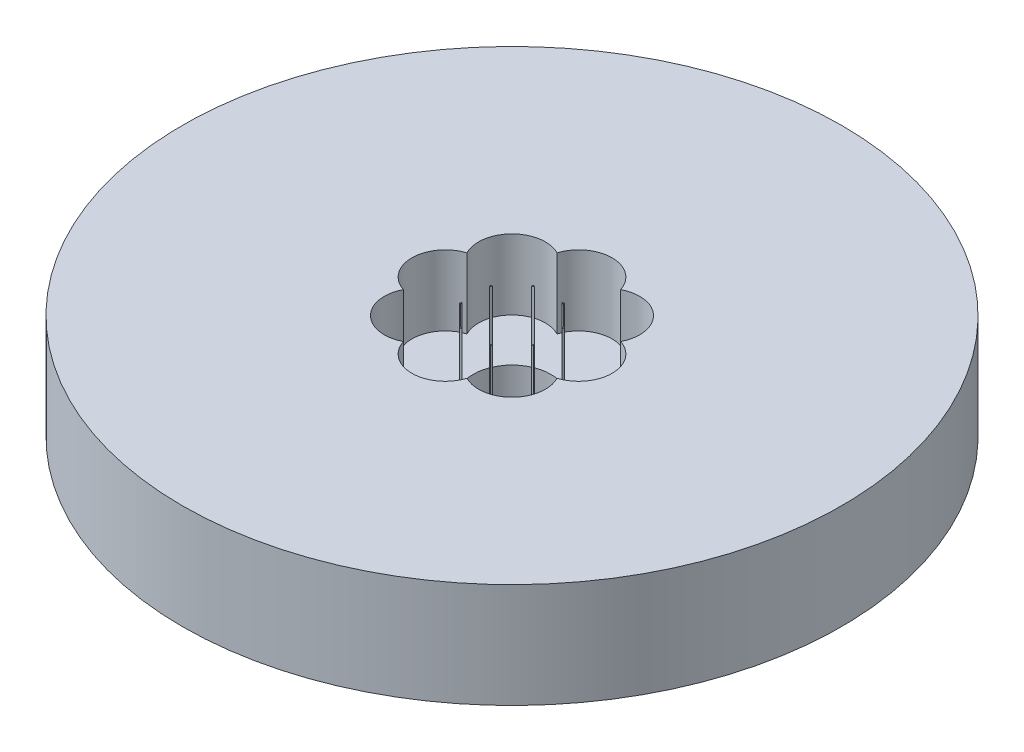
ISO-10303-21;
HEADER;
FILE_DESCRIPTION(('STEP AP214'),'2;1');
FILE_NAME('part.step','',(''),(''),'','','');
FILE_SCHEMA(('AUTOMOTIVE_DESIGN { 1 0 10303 214 1 1 1 1 }'));
ENDSEC;
DATA;
#1=APPLICATION_CONTEXT('core data for automotive mechanical design processes');
#2=APPLICATION_PROTOCOL_DEFINITION('international standard','automotive_design',2000,#1);
#3=PRODUCT_CONTEXT('',#1,'mechanical');
#4=PRODUCT('Part','Part','',(#3));
#5=PRODUCT_RELATED_PRODUCT_CATEGORY('part','',(#4));
#6=PRODUCT_DEFINITION_FORMATION('','',#4);
#7=PRODUCT_DEFINITION_CONTEXT('part definition',#1,'design');
#8=PRODUCT_DEFINITION('design','',#6,#7);
#9=PRODUCT_DEFINITION_SHAPE('','',#8);
#10=(LENGTH_UNIT() NAMED_UNIT(*) SI_UNIT(.MILLI.,.METRE.));
#11=(NAMED_UNIT(*) PLANE_ANGLE_UNIT() SI_UNIT($,.RADIAN.));
#12=(NAMED_UNIT(*) SI_UNIT($,.STERADIAN.) SOLID_ANGLE_UNIT());
#13=UNCERTAINTY_MEASURE_WITH_UNIT(LENGTH_MEASURE(1.E-05),#10,'distance_accuracy_value','');
#14=(GEOMETRIC_REPRESENTATION_CONTEXT(3) GLOBAL_UNCERTAINTY_ASSIGNED_CONTEXT((#13)) GLOBAL_UNIT_ASSIGNED_CONTEXT((#10,
#11,#12)) REPRESENTATION_CONTEXT('',''));
#15=CARTESIAN_POINT('',(0.,0.,0.));
#16=DIRECTION('',(0.,0.,1.));
#17=DIRECTION('',(1.,0.,0.));
#18=AXIS2_PLACEMENT_3D('',#15,#16,#17);
#19=CARTESIAN_POINT('',(0.,27.,0.));
#20=DIRECTION('',(0.,1.,0.));
#21=DIRECTION('',(0.,0.,1.));
#22=AXIS2_PLACEMENT_3D('',#19,#20,#21);
#23=PLANE('',#22);
#24=CARTESIAN_POINT('',(-12.1627005095586,27.,12.1627005095587));
#25=DIRECTION('',(0.,1.,0.));
#26=DIRECTION('',(0.707106781186549,0.,0.707106781186546));
#27=AXIS2_PLACEMENT_3D('',#24,#25,#26);
#28=CIRCLE('',#27,8.61132857241439);
#29=CARTESIAN_POINT('',(-9.11732362906765,27.,4.10784734901928));
#30=VERTEX_POINT('',#29);
#31=CARTESIAN_POINT('',(-9.55211556186566,27.,3.95661581507986));
#32=VERTEX_POINT('',#31);
#33=EDGE_CURVE('E380',#30,#32,#28,.T.);
#34=ORIENTED_EDGE('',*,*,#33,.F.);
#35=CARTESIAN_POINT('',(0.,27.,0.));
#36=DIRECTION('',(0.,1.,0.));
#37=DIRECTION('',(0.,0.,1.));
#38=AXIS2_PLACEMENT_3D('',#35,#36,#37);
#39=CIRCLE('',#38,10.);
#40=CARTESIAN_POINT('',(-9.35160808095678,27.,3.54223464781538));
#41=VERTEX_POINT('',#40);
#42=EDGE_CURVE('E407',#41,#30,#39,.T.);
#43=ORIENTED_EDGE('',*,*,#42,.F.);
#44=CARTESIAN_POINT('',(-17.2006560157,27.,0.));
#45=DIRECTION('',(0.,1.,0.));
#46=DIRECTION('',(0.,0.,1.));
#47=AXIS2_PLACEMENT_3D('',#44,#45,#46);
#48=CIRCLE('',#47,8.61132857241439);
#49=EDGE_CURVE('E410',#32,#41,#48,.T.);
#50=ORIENTED_EDGE('',*,*,#49,.F.);
#51=EDGE_LOOP('',(#34,#43,#50));
#52=FACE_BOUND('',#51,.T.);
#53=ADVANCED_FACE('F39',(#52),#23,.T.);
#54=CARTESIAN_POINT('',(-12.1627005095588,27.,-12.1627005095585));
#55=DIRECTION('',(0.,1.,0.));
#56=DIRECTION('',(-0.707106781186539,0.,0.707106781186556));
#57=AXIS2_PLACEMENT_3D('',#54,#55,#56);
#58=CIRCLE('',#57,8.61132857241439);
#59=CARTESIAN_POINT('',(-9.55211556186561,27.,-3.95661581507976));
#60=VERTEX_POINT('',#59);
#61=CARTESIAN_POINT('',(-9.11732362906771,27.,-4.10784734901915));
#62=VERTEX_POINT('',#61);
#63=EDGE_CURVE('E285',#60,#62,#58,.T.);
#64=ORIENTED_EDGE('',*,*,#63,.F.);
#65=CARTESIAN_POINT('',(-9.35160808095678,27.,-3.54223464781538));
#66=VERTEX_POINT('',#65);
#67=EDGE_CURVE('E401',#66,#60,#48,.T.);
#68=ORIENTED_EDGE('',*,*,#67,.F.);
#69=EDGE_CURVE('E412',#62,#66,#39,.T.);
#70=ORIENTED_EDGE('',*,*,#69,.F.);
#71=EDGE_LOOP('',(#64,#68,#70));
#72=FACE_BOUND('',#71,.T.);
#73=ADVANCED_FACE('F533',(#72),#23,.T.);
#74=CARTESIAN_POINT('',(-1.80167308484029E-13,27.,-17.2006560157));
#75=DIRECTION('',(0.,1.,0.));
#76=DIRECTION('',(-1.,0.,0.));
#77=AXIS2_PLACEMENT_3D('',#74,#75,#76);
#78=CIRCLE('',#77,8.61132857241439);
#79=CARTESIAN_POINT('',(3.54223464781528,27.,-9.35160808095682));
#80=VERTEX_POINT('',#79);
#81=CARTESIAN_POINT('',(3.95661581507976,27.,-9.5521155618657));
#82=VERTEX_POINT('',#81);
#83=EDGE_CURVE('E301',#80,#82,#78,.T.);
#84=ORIENTED_EDGE('',*,*,#83,.F.);
#85=CARTESIAN_POINT('',(4.10784734901918,27.,-9.11732362906769));
#86=VERTEX_POINT('',#85);
#87=EDGE_CURVE('E511',#86,#80,#39,.T.);
#88=ORIENTED_EDGE('',*,*,#87,.F.);
#89=CARTESIAN_POINT('',(12.1627005095585,27.,-12.1627005095588));
#90=DIRECTION('',(0.,1.,0.));
#91=DIRECTION('',(-0.707106781186554,0.,-0.707106781186541));
#92=AXIS2_PLACEMENT_3D('',#89,#90,#91);
#93=CIRCLE('',#92,8.61132857241439);
#94=EDGE_CURVE('E313',#82,#86,#93,.T.);
#95=ORIENTED_EDGE('',*,*,#94,.F.);
#96=EDGE_LOOP('',(#84,#88,#95));
#97=FACE_BOUND('',#96,.T.);
#98=ADVANCED_FACE('F574',(#97),#23,.T.);
#99=CARTESIAN_POINT('',(9.11732362906762,27.,-4.10784734901934));
#100=VERTEX_POINT('',#99);
#101=CARTESIAN_POINT('',(9.55211556186569,27.,-3.95661581507991));
#102=VERTEX_POINT('',#101);
#103=EDGE_CURVE('E315',#100,#102,#93,.T.);
#104=ORIENTED_EDGE('',*,*,#103,.F.);
#105=CARTESIAN_POINT('',(9.35160808095678,27.,-3.54223464781538));
#106=VERTEX_POINT('',#105);
#107=EDGE_CURVE('E512',#106,#100,#39,.T.);
#108=ORIENTED_EDGE('',*,*,#107,.F.);
#109=CARTESIAN_POINT('',(17.2006560157,27.,0.));
#110=DIRECTION('',(0.,1.,0.));
#111=DIRECTION('',(0.,0.,-1.));
#112=AXIS2_PLACEMENT_3D('',#109,#110,#111);
#113=CIRCLE('',#112,8.61132857241439);
#114=EDGE_CURVE('E324',#102,#106,#113,.T.);
#115=ORIENTED_EDGE('',*,*,#114,.F.);
#116=EDGE_LOOP('',(#104,#108,#115));
#117=FACE_BOUND('',#116,.T.);
#118=ADVANCED_FACE('F597',(#117),#23,.T.);
#119=CARTESIAN_POINT('',(9.35160808095678,27.,3.54223464781538));
#120=VERTEX_POINT('',#119);
#121=CARTESIAN_POINT('',(9.55211556186564,27.,3.95661581507981));
#122=VERTEX_POINT('',#121);
#123=EDGE_CURVE('E330',#120,#122,#113,.T.);
#124=ORIENTED_EDGE('',*,*,#123,.F.);
#125=CARTESIAN_POINT('',(9.11732362906768,27.,4.10784734901921));
#126=VERTEX_POINT('',#125);
#127=EDGE_CURVE('E502',#126,#120,#39,.T.);
#128=ORIENTED_EDGE('',*,*,#127,.F.);
#129=CARTESIAN_POINT('',(12.1627005095587,27.,12.1627005095586));
#130=DIRECTION('',(0.,1.,0.));
#131=DIRECTION('',(0.707106781186544,0.,-0.707106781186551));
#132=AXIS2_PLACEMENT_3D('',#129,#130,#131);
#133=CIRCLE('',#132,8.61132857241439);
#134=EDGE_CURVE('E336',#122,#126,#133,.T.);
#135=ORIENTED_EDGE('',*,*,#134,.F.);
#136=EDGE_LOOP('',(#124,#128,#135));
#137=FACE_BOUND('',#136,.T.);
#138=ADVANCED_FACE('F505',(#137),#23,.T.);
#139=CARTESIAN_POINT('',(4.10784734901931,27.,9.11732362906763));
#140=VERTEX_POINT('',#139);
#141=CARTESIAN_POINT('',(3.9566158150799,27.,9.55211556186565));
#142=VERTEX_POINT('',#141);
#143=EDGE_CURVE('E325',#140,#142,#133,.T.);
#144=ORIENTED_EDGE('',*,*,#143,.F.);
#145=CARTESIAN_POINT('',(3.54223464781541,27.,9.35160808095677));
#146=VERTEX_POINT('',#145);
#147=EDGE_CURVE('E509',#146,#140,#39,.T.);
#148=ORIENTED_EDGE('',*,*,#147,.F.);
#149=CARTESIAN_POINT('',(0.,27.,17.2006560157));
#150=DIRECTION('',(0.,1.,0.));
#151=DIRECTION('',(1.,0.,0.));
#152=AXIS2_PLACEMENT_3D('',#149,#150,#151);
#153=CIRCLE('',#152,8.61132857241439);
#154=EDGE_CURVE('E349',#142,#146,#153,.T.);
#155=ORIENTED_EDGE('',*,*,#154,.F.);
#156=EDGE_LOOP('',(#144,#148,#155));
#157=FACE_BOUND('',#156,.T.);
#158=ADVANCED_FACE('F508',(#157),#23,.T.);
#159=CARTESIAN_POINT('',(-3.54223464781535,27.,9.3516080809568));
#160=VERTEX_POINT('',#159);
#161=CARTESIAN_POINT('',(-3.95661581507983,27.,9.55211556186567));
#162=VERTEX_POINT('',#161);
#163=EDGE_CURVE('E351',#160,#162,#153,.T.);
#164=ORIENTED_EDGE('',*,*,#163,.F.);
#165=CARTESIAN_POINT('',(-4.10784734901925,27.,9.11732362906766));
#166=VERTEX_POINT('',#165);
#167=EDGE_CURVE('E415',#166,#160,#39,.T.);
#168=ORIENTED_EDGE('',*,*,#167,.F.);
#169=EDGE_CURVE('E374',#162,#166,#28,.T.);
#170=ORIENTED_EDGE('',*,*,#169,.F.);
#171=EDGE_LOOP('',(#164,#168,#170));
#172=FACE_BOUND('',#171,.T.);
#173=ADVANCED_FACE('F467',(#172),#23,.T.);
#174=CARTESIAN_POINT('',(-3.95661581507996,27.,-9.55211556186562));
#175=VERTEX_POINT('',#174);
#176=CARTESIAN_POINT('',(-3.54223464781548,27.,-9.35160808095675));
#177=VERTEX_POINT('',#176);
#178=EDGE_CURVE('E257',#175,#177,#78,.T.);
#179=ORIENTED_EDGE('',*,*,#178,.F.);
#180=CARTESIAN_POINT('',(-4.10784734901937,27.,-9.11732362906761));
#181=VERTEX_POINT('',#180);
#182=EDGE_CURVE('E282',#181,#175,#58,.T.);
#183=ORIENTED_EDGE('',*,*,#182,.F.);
#184=EDGE_CURVE('E299',#177,#181,#39,.T.);
#185=ORIENTED_EDGE('',*,*,#184,.F.);
#186=EDGE_LOOP('',(#179,#183,#185));
#187=FACE_BOUND('',#186,.T.);
#188=ADVANCED_FACE('F298',(#187),#23,.T.);
#189=CARTESIAN_POINT('',(-17.2006560157,8.87887620298357,0.));
#190=DIRECTION('',(0.,1.,0.));
#191=DIRECTION('',(0.,0.,1.));
#192=AXIS2_PLACEMENT_3D('',#189,#190,#191);
#193=CYLINDRICAL_SURFACE('',#192,8.61132857241439);
#194=CARTESIAN_POINT('',(-17.2006560157,8.87887620298357,0.));
#195=DIRECTION('',(0.,1.,0.));
#196=DIRECTION('',(0.,0.,1.));
#197=AXIS2_PLACEMENT_3D('',#194,#195,#196);
#198=CIRCLE('',#197,8.61132857241439);
#199=CARTESIAN_POINT('',(-9.55211556186566,8.87887620298357,3.95661581507986));
#200=VERTEX_POINT('',#199);
#201=CARTESIAN_POINT('',(-9.35160808095678,8.87887620298357,3.54223464781538));
#202=VERTEX_POINT('',#201);
#203=EDGE_CURVE('E65',#200,#202,#198,.T.);
#204=ORIENTED_EDGE('',*,*,#203,.F.);
#205=DIRECTION('',(0.,1.,0.));
#206=VECTOR('',#205,1.);
#207=CARTESIAN_POINT('',(-9.55211556186566,17.9394381014918,3.95661581507986));
#208=LINE('',#207,#206);
#209=EDGE_CURVE('E387',#200,#32,#208,.T.);
#210=ORIENTED_EDGE('',*,*,#209,.T.);
#211=ORIENTED_EDGE('',*,*,#49,.T.);
#212=DIRECTION('',(0.,1.,0.));
#213=VECTOR('',#212,1.);
#214=CARTESIAN_POINT('',(-9.35160808095678,17.9394381014918,3.54223464781538));
#215=LINE('',#214,#213);
#216=EDGE_CURVE('E424',#41,#202,#215,.F.);
#217=ORIENTED_EDGE('',*,*,#216,.T.);
#218=EDGE_LOOP('',(#204,#210,#211,#217));
#219=FACE_BOUND('',#218,.T.);
#220=ADVANCED_FACE('F590',(#219),#193,.F.);
#221=CARTESIAN_POINT('',(-19.8112409633932,27.,-8.20608469447873));
#222=VERTEX_POINT('',#221);
#223=CARTESIAN_POINT('',(-19.811240963393,27.,8.20608469447881));
#224=VERTEX_POINT('',#223);
#225=EDGE_CURVE('E406',#222,#224,#48,.T.);
#226=ORIENTED_EDGE('',*,*,#225,.T.);
#227=DIRECTION('',(0.,1.,0.));
#228=VECTOR('',#227,1.);
#229=CARTESIAN_POINT('',(-19.811240963393,17.9394381014918,8.20608469447881));
#230=LINE('',#229,#228);
#231=CARTESIAN_POINT('',(-19.811240963393,8.87887620298357,8.20608469447881));
#232=VERTEX_POINT('',#231);
#233=EDGE_CURVE('E382',#224,#232,#230,.F.);
#234=ORIENTED_EDGE('',*,*,#233,.T.);
#235=CARTESIAN_POINT('',(-19.8112409633932,8.87887620298357,-8.20608469447874));
#236=VERTEX_POINT('',#235);
#237=EDGE_CURVE('E405',#236,#232,#198,.T.);
#238=ORIENTED_EDGE('',*,*,#237,.F.);
#239=DIRECTION('',(0.,1.,0.));
#240=VECTOR('',#239,1.);
#241=CARTESIAN_POINT('',(-19.8112409633932,17.9394381014918,-8.20608469447874));
#242=LINE('',#241,#240);
#243=EDGE_CURVE('E273',#236,#222,#242,.T.);
#244=ORIENTED_EDGE('',*,*,#243,.T.);
#245=EDGE_LOOP('',(#226,#234,#238,#244));
#246=FACE_BOUND('',#245,.T.);
#247=ADVANCED_FACE('F544',(#246),#193,.F.);
#248=CARTESIAN_POINT('',(0.,27.,0.));
#249=DIRECTION('',(0.,-1.,0.));
#250=DIRECTION('',(0.,0.,-1.));
#251=AXIS2_PLACEMENT_3D('',#248,#249,#250);
#252=CYLINDRICAL_SURFACE('',#251,85.);
#253=CARTESIAN_POINT('',(0.,27.,0.));
#254=DIRECTION('',(0.,1.,0.));
#255=DIRECTION('',(0.,0.,1.));
#256=AXIS2_PLACEMENT_3D('',#253,#254,#255);
#257=CIRCLE('',#256,85.);
#258=CARTESIAN_POINT('',(0.,27.,85.));
#259=VERTEX_POINT('',#258);
#260=EDGE_CURVE('E418',#259,#259,#257,.T.);
#261=ORIENTED_EDGE('',*,*,#260,.F.);
#262=EDGE_LOOP('',(#261));
#263=FACE_BOUND('',#262,.T.);
#264=CARTESIAN_POINT('',(0.,0.,0.));
#265=DIRECTION('',(0.,1.,0.));
#266=DIRECTION('',(0.,0.,1.));
#267=AXIS2_PLACEMENT_3D('',#264,#265,#266);
#268=CIRCLE('',#267,85.);
#269=CARTESIAN_POINT('',(0.,0.,85.));
#270=VERTEX_POINT('',#269);
#271=EDGE_CURVE('E411',#270,#270,#268,.T.);
#272=ORIENTED_EDGE('',*,*,#271,.T.);
#273=EDGE_LOOP('',(#272));
#274=FACE_BOUND('',#273,.T.);
#275=ADVANCED_FACE('F41',(#263,#274),#252,.T.);
#276=CARTESIAN_POINT('',(-8.20608469447874,27.,19.811240963393));
#277=VERTEX_POINT('',#276);
#278=EDGE_CURVE('E366',#224,#277,#28,.T.);
#279=ORIENTED_EDGE('',*,*,#278,.F.);
#280=ORIENTED_EDGE('',*,*,#225,.F.);
#281=CARTESIAN_POINT('',(-8.20608469447901,27.,-19.8112409633929));
#282=VERTEX_POINT('',#281);
#283=EDGE_CURVE('E279',#282,#222,#58,.T.);
#284=ORIENTED_EDGE('',*,*,#283,.F.);
#285=CARTESIAN_POINT('',(8.2060846944786,27.,-19.811240963393));
#286=VERTEX_POINT('',#285);
#287=EDGE_CURVE('E270',#286,#282,#78,.T.);
#288=ORIENTED_EDGE('',*,*,#287,.F.);
#289=CARTESIAN_POINT('',(19.8112409633929,27.,-8.20608469447884));
#290=VERTEX_POINT('',#289);
#291=EDGE_CURVE('E306',#290,#286,#93,.T.);
#292=ORIENTED_EDGE('',*,*,#291,.F.);
#293=CARTESIAN_POINT('',(19.8112409633931,27.,8.20608469447877));
#294=VERTEX_POINT('',#293);
#295=EDGE_CURVE('E318',#294,#290,#113,.T.);
#296=ORIENTED_EDGE('',*,*,#295,.F.);
#297=CARTESIAN_POINT('',(8.20608469447888,27.,19.8112409633929));
#298=VERTEX_POINT('',#297);
#299=EDGE_CURVE('E334',#298,#294,#133,.T.);
#300=ORIENTED_EDGE('',*,*,#299,.F.);
#301=EDGE_CURVE('E345',#277,#298,#153,.T.);
#302=ORIENTED_EDGE('',*,*,#301,.F.);
#303=EDGE_LOOP('',(#279,#280,#284,#288,#292,#296,#300,#302));
#304=FACE_BOUND('',#303,.T.);
#305=ORIENTED_EDGE('',*,*,#260,.T.);
#306=EDGE_LOOP('',(#305));
#307=FACE_BOUND('',#306,.T.);
#308=ADVANCED_FACE('F485',(#304,#307),#23,.T.);
#309=CARTESIAN_POINT('',(0.,0.,0.));
#310=DIRECTION('',(0.,1.,0.));
#311=DIRECTION('',(0.,0.,1.));
#312=AXIS2_PLACEMENT_3D('',#309,#310,#311);
#313=PLANE('',#312);
#314=CARTESIAN_POINT('',(0.,0.,0.));
#315=DIRECTION('',(0.,1.,0.));
#316=DIRECTION('',(0.,0.,1.));
#317=AXIS2_PLACEMENT_3D('',#314,#315,#316);
#318=CIRCLE('',#317,10.);
#319=CARTESIAN_POINT('',(0.,0.,10.));
#320=VERTEX_POINT('',#319);
#321=EDGE_CURVE('E402',#320,#320,#318,.T.);
#322=ORIENTED_EDGE('',*,*,#321,.T.);
#323=EDGE_LOOP('',(#322));
#324=FACE_BOUND('',#323,.T.);
#325=ORIENTED_EDGE('',*,*,#271,.F.);
#326=EDGE_LOOP('',(#325));
#327=FACE_BOUND('',#326,.T.);
#328=ADVANCED_FACE('F577',(#324,#327),#313,.F.);
#329=CARTESIAN_POINT('',(0.,27.,0.));
#330=DIRECTION('',(0.,-1.,0.));
#331=DIRECTION('',(0.,0.,-1.));
#332=AXIS2_PLACEMENT_3D('',#329,#330,#331);
#333=CYLINDRICAL_SURFACE('',#332,10.);
#334=DIRECTION('',(0.,1.,0.));
#335=VECTOR('',#334,1.);
#336=CARTESIAN_POINT('',(-9.11732362906765,17.9394381014918,4.10784734901928));
#337=LINE('',#336,#335);
#338=CARTESIAN_POINT('',(-9.11732362906765,8.87887620298357,4.10784734901928));
#339=VERTEX_POINT('',#338);
#340=EDGE_CURVE('E391',#339,#30,#337,.T.);
#341=ORIENTED_EDGE('',*,*,#340,.F.);
#342=CARTESIAN_POINT('',(0.,8.87887620298357,0.));
#343=DIRECTION('',(0.,1.,0.));
#344=DIRECTION('',(0.,0.,1.));
#345=AXIS2_PLACEMENT_3D('',#342,#343,#344);
#346=CIRCLE('',#345,10.);
#347=CARTESIAN_POINT('',(-4.10784734901925,8.87887620298357,9.11732362906766));
#348=VERTEX_POINT('',#347);
#349=EDGE_CURVE('E396',#339,#348,#346,.T.);
#350=ORIENTED_EDGE('',*,*,#349,.T.);
#351=DIRECTION('',(0.,1.,0.));
#352=VECTOR('',#351,1.);
#353=CARTESIAN_POINT('',(-4.10784734901925,17.9394381014918,9.11732362906766));
#354=LINE('',#353,#352);
#355=EDGE_CURVE('E386',#166,#348,#354,.F.);
#356=ORIENTED_EDGE('',*,*,#355,.F.);
#357=ORIENTED_EDGE('',*,*,#167,.T.);
#358=DIRECTION('',(0.,1.,0.));
#359=VECTOR('',#358,1.);
#360=CARTESIAN_POINT('',(-3.54223464781535,17.9394381014918,9.3516080809568));
#361=LINE('',#360,#359);
#362=CARTESIAN_POINT('',(-3.54223464781535,8.87887620298357,9.3516080809568));
#363=VERTEX_POINT('',#362);
#364=EDGE_CURVE('E11',#363,#160,#361,.T.);
#365=ORIENTED_EDGE('',*,*,#364,.F.);
#366=CARTESIAN_POINT('',(3.54223464781541,8.87887620298357,9.35160808095677));
#367=VERTEX_POINT('',#366);
#368=EDGE_CURVE('E392',#363,#367,#346,.T.);
#369=ORIENTED_EDGE('',*,*,#368,.T.);
#370=DIRECTION('',(0.,1.,0.));
#371=VECTOR('',#370,1.);
#372=CARTESIAN_POINT('',(3.54223464781541,17.9394381014918,9.35160808095677));
#373=LINE('',#372,#371);
#374=EDGE_CURVE('E50',#146,#367,#373,.F.);
#375=ORIENTED_EDGE('',*,*,#374,.F.);
#376=ORIENTED_EDGE('',*,*,#147,.T.);
#377=DIRECTION('',(0.,1.,0.));
#378=VECTOR('',#377,1.);
#379=CARTESIAN_POINT('',(4.10784734901931,17.9394381014918,9.11732362906763));
#380=LINE('',#379,#378);
#381=CARTESIAN_POINT('',(4.10784734901931,8.87887620298357,9.11732362906763));
#382=VERTEX_POINT('',#381);
#383=EDGE_CURVE('E438',#382,#140,#380,.T.);
#384=ORIENTED_EDGE('',*,*,#383,.F.);
#385=CARTESIAN_POINT('',(9.11732362906768,8.87887620298357,4.10784734901921));
#386=VERTEX_POINT('',#385);
#387=EDGE_CURVE('E400',#382,#386,#346,.T.);
#388=ORIENTED_EDGE('',*,*,#387,.T.);
#389=DIRECTION('',(0.,1.,0.));
#390=VECTOR('',#389,1.);
#391=CARTESIAN_POINT('',(9.11732362906768,17.9394381014918,4.10784734901921));
#392=LINE('',#391,#390);
#393=EDGE_CURVE('E440',#126,#386,#392,.F.);
#394=ORIENTED_EDGE('',*,*,#393,.F.);
#395=ORIENTED_EDGE('',*,*,#127,.T.);
#396=DIRECTION('',(0.,1.,0.));
#397=VECTOR('',#396,1.);
#398=CARTESIAN_POINT('',(9.35160808095678,17.9394381014918,3.54223464781538));
#399=LINE('',#398,#397);
#400=CARTESIAN_POINT('',(9.35160808095678,8.87887620298357,3.54223464781538));
#401=VERTEX_POINT('',#400);
#402=EDGE_CURVE('E434',#401,#120,#399,.T.);
#403=ORIENTED_EDGE('',*,*,#402,.F.);
#404=CARTESIAN_POINT('',(9.35160808095678,8.87887620298357,-3.54223464781538));
#405=VERTEX_POINT('',#404);
#406=EDGE_CURVE('E550',#401,#405,#346,.T.);
#407=ORIENTED_EDGE('',*,*,#406,.T.);
#408=DIRECTION('',(0.,1.,0.));
#409=VECTOR('',#408,1.);
#410=CARTESIAN_POINT('',(9.35160808095678,17.9394381014918,-3.54223464781538));
#411=LINE('',#410,#409);
#412=EDGE_CURVE('E433',#106,#405,#411,.F.);
#413=ORIENTED_EDGE('',*,*,#412,.F.);
#414=ORIENTED_EDGE('',*,*,#107,.T.);
#415=DIRECTION('',(0.,1.,0.));
#416=VECTOR('',#415,1.);
#417=CARTESIAN_POINT('',(9.11732362906762,17.9394381014918,-4.10784734901934));
#418=LINE('',#417,#416);
#419=CARTESIAN_POINT('',(9.11732362906762,8.87887620298357,-4.10784734901934));
#420=VERTEX_POINT('',#419);
#421=EDGE_CURVE('E444',#420,#100,#418,.T.);
#422=ORIENTED_EDGE('',*,*,#421,.F.);
#423=CARTESIAN_POINT('',(4.10784734901918,8.87887620298357,-9.11732362906769));
#424=VERTEX_POINT('',#423);
#425=EDGE_CURVE('E548',#420,#424,#346,.T.);
#426=ORIENTED_EDGE('',*,*,#425,.T.);
#427=DIRECTION('',(0.,1.,0.));
#428=VECTOR('',#427,1.);
#429=CARTESIAN_POINT('',(4.10784734901918,17.9394381014918,-9.11732362906769));
#430=LINE('',#429,#428);
#431=EDGE_CURVE('E442',#86,#424,#430,.F.);
#432=ORIENTED_EDGE('',*,*,#431,.F.);
#433=ORIENTED_EDGE('',*,*,#87,.T.);
#434=DIRECTION('',(0.,1.,0.));
#435=VECTOR('',#434,1.);
#436=CARTESIAN_POINT('',(3.54223464781528,17.9394381014918,-9.35160808095682));
#437=LINE('',#436,#435);
#438=CARTESIAN_POINT('',(3.54223464781528,8.87887620298357,-9.35160808095682));
#439=VERTEX_POINT('',#438);
#440=EDGE_CURVE('E431',#439,#80,#437,.T.);
#441=ORIENTED_EDGE('',*,*,#440,.F.);
#442=CARTESIAN_POINT('',(-3.54223464781548,8.87887620298357,-9.35160808095675));
#443=VERTEX_POINT('',#442);
#444=EDGE_CURVE('E552',#439,#443,#346,.T.);
#445=ORIENTED_EDGE('',*,*,#444,.T.);
#446=DIRECTION('',(0.,1.,0.));
#447=VECTOR('',#446,1.);
#448=CARTESIAN_POINT('',(-3.54223464781548,17.9394381014918,-9.35160808095675));
#449=LINE('',#448,#447);
#450=EDGE_CURVE('E427',#177,#443,#449,.F.);
#451=ORIENTED_EDGE('',*,*,#450,.F.);
#452=ORIENTED_EDGE('',*,*,#184,.T.);
#453=DIRECTION('',(0.,1.,0.));
#454=VECTOR('',#453,1.);
#455=CARTESIAN_POINT('',(-4.10784734901937,17.9394381014918,-9.11732362906761));
#456=LINE('',#455,#454);
#457=CARTESIAN_POINT('',(-4.10784734901937,8.87887620298357,-9.11732362906761));
#458=VERTEX_POINT('',#457);
#459=EDGE_CURVE('E289',#458,#181,#456,.T.);
#460=ORIENTED_EDGE('',*,*,#459,.F.);
#461=CARTESIAN_POINT('',(-9.11732362906771,8.87887620298357,-4.10784734901915));
#462=VERTEX_POINT('',#461);
#463=EDGE_CURVE('E554',#458,#462,#346,.T.);
#464=ORIENTED_EDGE('',*,*,#463,.T.);
#465=DIRECTION('',(0.,1.,0.));
#466=VECTOR('',#465,1.);
#467=CARTESIAN_POINT('',(-9.11732362906771,17.9394381014918,-4.10784734901915));
#468=LINE('',#467,#466);
#469=EDGE_CURVE('E379',#62,#462,#468,.F.);
#470=ORIENTED_EDGE('',*,*,#469,.F.);
#471=ORIENTED_EDGE('',*,*,#69,.T.);
#472=DIRECTION('',(0.,1.,0.));
#473=VECTOR('',#472,1.);
#474=CARTESIAN_POINT('',(-9.35160808095678,17.9394381014918,-3.54223464781538));
#475=LINE('',#474,#473);
#476=CARTESIAN_POINT('',(-9.35160808095678,8.87887620298357,-3.54223464781538));
#477=VERTEX_POINT('',#476);
#478=EDGE_CURVE('E426',#477,#66,#475,.T.);
#479=ORIENTED_EDGE('',*,*,#478,.F.);
#480=CARTESIAN_POINT('',(0.,8.87887620298357,0.));
#481=DIRECTION('',(0.,1.,0.));
#482=DIRECTION('',(0.,0.,1.));
#483=AXIS2_PLACEMENT_3D('',#480,#481,#482);
#484=CIRCLE('',#483,10.);
#485=EDGE_CURVE('E420',#477,#202,#484,.T.);
#486=ORIENTED_EDGE('',*,*,#485,.T.);
#487=ORIENTED_EDGE('',*,*,#216,.F.);
#488=ORIENTED_EDGE('',*,*,#42,.T.);
#489=EDGE_LOOP('',(#341,#350,#356,#357,#365,#369,#375,#376,#384,#388,#394,#395,#403,#407,#413,
#414,#422,#426,#432,#433,#441,#445,#451,#452,#460,#464,#470,#471,#479,#486,#487,#488));
#490=FACE_BOUND('',#489,.T.);
#491=ORIENTED_EDGE('',*,*,#321,.F.);
#492=EDGE_LOOP('',(#491));
#493=FACE_BOUND('',#492,.T.);
#494=ADVANCED_FACE('F460',(#490,#493),#333,.F.);
#495=ORIENTED_EDGE('',*,*,#67,.T.);
#496=DIRECTION('',(0.,1.,0.));
#497=VECTOR('',#496,1.);
#498=CARTESIAN_POINT('',(-9.55211556186561,17.9394381014918,-3.95661581507976));
#499=LINE('',#498,#497);
#500=CARTESIAN_POINT('',(-9.55211556186561,8.87887620298357,-3.95661581507976));
#501=VERTEX_POINT('',#500);
#502=EDGE_CURVE('E375',#60,#501,#499,.F.);
#503=ORIENTED_EDGE('',*,*,#502,.T.);
#504=EDGE_CURVE('E397',#477,#501,#198,.T.);
#505=ORIENTED_EDGE('',*,*,#504,.F.);
#506=ORIENTED_EDGE('',*,*,#478,.T.);
#507=EDGE_LOOP('',(#495,#503,#505,#506));
#508=FACE_BOUND('',#507,.T.);
#509=ADVANCED_FACE('F529',(#508),#193,.F.);
#510=CARTESIAN_POINT('',(-17.2006560157,8.87887620298357,0.));
#511=DIRECTION('',(0.,1.,0.));
#512=DIRECTION('',(0.,0.,1.));
#513=AXIS2_PLACEMENT_3D('',#510,#511,#512);
#514=PLANE('',#513);
#515=CARTESIAN_POINT('',(-12.1627005095588,8.87887620298357,-12.1627005095585));
#516=DIRECTION('',(0.,1.,0.));
#517=DIRECTION('',(-0.707106781186539,0.,0.707106781186556));
#518=AXIS2_PLACEMENT_3D('',#515,#516,#517);
#519=CIRCLE('',#518,8.61132857241439);
#520=CARTESIAN_POINT('',(-8.20608469447902,8.87887620298357,-19.8112409633929));
#521=VERTEX_POINT('',#520);
#522=EDGE_CURVE('E251',#521,#236,#519,.T.);
#523=ORIENTED_EDGE('',*,*,#522,.T.);
#524=ORIENTED_EDGE('',*,*,#237,.T.);
#525=CARTESIAN_POINT('',(-12.1627005095586,8.87887620298357,12.1627005095587));
#526=DIRECTION('',(0.,1.,0.));
#527=DIRECTION('',(0.707106781186549,0.,0.707106781186546));
#528=AXIS2_PLACEMENT_3D('',#525,#526,#527);
#529=CIRCLE('',#528,8.61132857241439);
#530=CARTESIAN_POINT('',(-8.20608469447874,8.87887620298357,19.811240963393));
#531=VERTEX_POINT('',#530);
#532=EDGE_CURVE('E372',#232,#531,#529,.T.);
#533=ORIENTED_EDGE('',*,*,#532,.T.);
#534=CARTESIAN_POINT('',(0.,8.87887620298357,17.2006560157));
#535=DIRECTION('',(0.,1.,0.));
#536=DIRECTION('',(1.,0.,0.));
#537=AXIS2_PLACEMENT_3D('',#534,#535,#536);
#538=CIRCLE('',#537,8.61132857241439);
#539=CARTESIAN_POINT('',(8.20608469447888,8.87887620298357,19.8112409633929));
#540=VERTEX_POINT('',#539);
#541=EDGE_CURVE('E346',#531,#540,#538,.T.);
#542=ORIENTED_EDGE('',*,*,#541,.T.);
#543=CARTESIAN_POINT('',(12.1627005095587,8.87887620298357,12.1627005095586));
#544=DIRECTION('',(0.,1.,0.));
#545=DIRECTION('',(0.707106781186544,0.,-0.707106781186551));
#546=AXIS2_PLACEMENT_3D('',#543,#544,#545);
#547=CIRCLE('',#546,8.61132857241439);
#548=CARTESIAN_POINT('',(19.8112409633931,8.87887620298357,8.20608469447877));
#549=VERTEX_POINT('',#548);
#550=EDGE_CURVE('E327',#540,#549,#547,.T.);
#551=ORIENTED_EDGE('',*,*,#550,.T.);
#552=CARTESIAN_POINT('',(17.2006560157,8.87887620298357,0.));
#553=DIRECTION('',(0.,1.,0.));
#554=DIRECTION('',(0.,0.,-1.));
#555=AXIS2_PLACEMENT_3D('',#552,#553,#554);
#556=CIRCLE('',#555,8.61132857241439);
#557=CARTESIAN_POINT('',(19.8112409633929,8.87887620298357,-8.20608469447884));
#558=VERTEX_POINT('',#557);
#559=EDGE_CURVE('E322',#549,#558,#556,.T.);
#560=ORIENTED_EDGE('',*,*,#559,.T.);
#561=CARTESIAN_POINT('',(12.1627005095585,8.87887620298357,-12.1627005095588));
#562=DIRECTION('',(0.,1.,0.));
#563=DIRECTION('',(-0.707106781186554,0.,-0.707106781186541));
#564=AXIS2_PLACEMENT_3D('',#561,#562,#563);
#565=CIRCLE('',#564,8.61132857241439);
#566=CARTESIAN_POINT('',(8.2060846944786,8.87887620298357,-19.811240963393));
#567=VERTEX_POINT('',#566);
#568=EDGE_CURVE('E258',#558,#567,#565,.T.);
#569=ORIENTED_EDGE('',*,*,#568,.T.);
#570=CARTESIAN_POINT('',(-1.80167308484029E-13,8.87887620298357,-17.2006560157));
#571=DIRECTION('',(0.,1.,0.));
#572=DIRECTION('',(-1.,0.,0.));
#573=AXIS2_PLACEMENT_3D('',#570,#571,#572);
#574=CIRCLE('',#573,8.61132857241439);
#575=EDGE_CURVE('E247',#567,#521,#574,.T.);
#576=ORIENTED_EDGE('',*,*,#575,.T.);
#577=EDGE_LOOP('',(#523,#524,#533,#542,#551,#560,#569,#576));
#578=FACE_BOUND('',#577,.T.);
#579=ORIENTED_EDGE('',*,*,#504,.T.);
#580=EDGE_CURVE('E53',#501,#462,#519,.T.);
#581=ORIENTED_EDGE('',*,*,#580,.T.);
#582=ORIENTED_EDGE('',*,*,#463,.F.);
#583=CARTESIAN_POINT('',(-3.95661581507996,8.87887620298357,-9.55211556186562));
#584=VERTEX_POINT('',#583);
#585=EDGE_CURVE('E277',#458,#584,#519,.T.);
#586=ORIENTED_EDGE('',*,*,#585,.T.);
#587=EDGE_CURVE('E265',#584,#443,#574,.T.);
#588=ORIENTED_EDGE('',*,*,#587,.T.);
#589=ORIENTED_EDGE('',*,*,#444,.F.);
#590=CARTESIAN_POINT('',(3.95661581507976,8.87887620298357,-9.5521155618657));
#591=VERTEX_POINT('',#590);
#592=EDGE_CURVE('E259',#439,#591,#574,.T.);
#593=ORIENTED_EDGE('',*,*,#592,.T.);
#594=EDGE_CURVE('E308',#591,#424,#565,.T.);
#595=ORIENTED_EDGE('',*,*,#594,.T.);
#596=ORIENTED_EDGE('',*,*,#425,.F.);
#597=CARTESIAN_POINT('',(9.55211556186569,8.87887620298357,-3.95661581507991));
#598=VERTEX_POINT('',#597);
#599=EDGE_CURVE('E307',#420,#598,#565,.T.);
#600=ORIENTED_EDGE('',*,*,#599,.T.);
#601=EDGE_CURVE('E317',#598,#405,#556,.T.);
#602=ORIENTED_EDGE('',*,*,#601,.T.);
#603=ORIENTED_EDGE('',*,*,#406,.F.);
#604=CARTESIAN_POINT('',(9.55211556186564,8.87887620298357,3.95661581507981));
#605=VERTEX_POINT('',#604);
#606=EDGE_CURVE('E323',#401,#605,#556,.T.);
#607=ORIENTED_EDGE('',*,*,#606,.T.);
#608=EDGE_CURVE('E332',#605,#386,#547,.T.);
#609=ORIENTED_EDGE('',*,*,#608,.T.);
#610=ORIENTED_EDGE('',*,*,#387,.F.);
#611=CARTESIAN_POINT('',(3.9566158150799,8.87887620298357,9.55211556186565));
#612=VERTEX_POINT('',#611);
#613=EDGE_CURVE('E335',#382,#612,#547,.T.);
#614=ORIENTED_EDGE('',*,*,#613,.T.);
#615=EDGE_CURVE('E342',#612,#367,#538,.T.);
#616=ORIENTED_EDGE('',*,*,#615,.T.);
#617=ORIENTED_EDGE('',*,*,#368,.F.);
#618=CARTESIAN_POINT('',(-3.95661581507983,8.87887620298357,9.55211556186567));
#619=VERTEX_POINT('',#618);
#620=EDGE_CURVE('E350',#363,#619,#538,.T.);
#621=ORIENTED_EDGE('',*,*,#620,.T.);
#622=EDGE_CURVE('E369',#619,#348,#529,.T.);
#623=ORIENTED_EDGE('',*,*,#622,.T.);
#624=ORIENTED_EDGE('',*,*,#349,.F.);
#625=EDGE_CURVE('E373',#339,#200,#529,.T.);
#626=ORIENTED_EDGE('',*,*,#625,.T.);
#627=ORIENTED_EDGE('',*,*,#203,.T.);
#628=ORIENTED_EDGE('',*,*,#485,.F.);
#629=EDGE_LOOP('',(#579,#581,#582,#586,#588,#589,#593,#595,#596,#600,#602,#603,#607,#609,#610,
#614,#616,#617,#621,#623,#624,#626,#627,#628));
#630=FACE_BOUND('',#629,.T.);
#631=ADVANCED_FACE('F249',(#578,#630),#514,.T.);
#632=CARTESIAN_POINT('',(0.,8.87887620298357,17.2006560157));
#633=DIRECTION('',(0.,1.,0.));
#634=DIRECTION('',(0.,0.,1.));
#635=AXIS2_PLACEMENT_3D('',#632,#633,#634);
#636=CYLINDRICAL_SURFACE('',#635,8.61132857241439);
#637=ORIENTED_EDGE('',*,*,#364,.T.);
#638=ORIENTED_EDGE('',*,*,#163,.T.);
#639=DIRECTION('',(0.,1.,0.));
#640=VECTOR('',#639,1.);
#641=CARTESIAN_POINT('',(-3.95661581507983,17.9394381014918,9.55211556186568));
#642=LINE('',#641,#640);
#643=EDGE_CURVE('E364',#619,#162,#642,.T.);
#644=ORIENTED_EDGE('',*,*,#643,.F.);
#645=ORIENTED_EDGE('',*,*,#620,.F.);
#646=EDGE_LOOP('',(#637,#638,#644,#645));
#647=FACE_BOUND('',#646,.T.);
#648=ADVANCED_FACE('F463',(#647),#636,.F.);
#649=CARTESIAN_POINT('',(12.1627005095585,8.87887620298357,-12.1627005095588));
#650=DIRECTION('',(0.,1.,0.));
#651=DIRECTION('',(0.,0.,1.));
#652=AXIS2_PLACEMENT_3D('',#649,#650,#651);
#653=CYLINDRICAL_SURFACE('',#652,8.61132857241439);
#654=ORIENTED_EDGE('',*,*,#421,.T.);
#655=ORIENTED_EDGE('',*,*,#103,.T.);
#656=DIRECTION('',(0.,1.,0.));
#657=VECTOR('',#656,1.);
#658=CARTESIAN_POINT('',(9.55211556186569,17.9394381014918,-3.95661581507991));
#659=LINE('',#658,#657);
#660=EDGE_CURVE('E312',#598,#102,#659,.T.);
#661=ORIENTED_EDGE('',*,*,#660,.F.);
#662=ORIENTED_EDGE('',*,*,#599,.F.);
#663=EDGE_LOOP('',(#654,#655,#661,#662));
#664=FACE_BOUND('',#663,.T.);
#665=ADVANCED_FACE('F621',(#664),#653,.F.);
#666=CARTESIAN_POINT('',(12.1627005095587,8.87887620298357,12.1627005095586));
#667=DIRECTION('',(0.,1.,0.));
#668=DIRECTION('',(0.,0.,1.));
#669=AXIS2_PLACEMENT_3D('',#666,#667,#668);
#670=CYLINDRICAL_SURFACE('',#669,8.61132857241439);
#671=ORIENTED_EDGE('',*,*,#383,.T.);
#672=ORIENTED_EDGE('',*,*,#143,.T.);
#673=DIRECTION('',(0.,1.,0.));
#674=VECTOR('',#673,1.);
#675=CARTESIAN_POINT('',(3.9566158150799,17.9394381014918,9.55211556186565));
#676=LINE('',#675,#674);
#677=EDGE_CURVE('E338',#612,#142,#676,.T.);
#678=ORIENTED_EDGE('',*,*,#677,.F.);
#679=ORIENTED_EDGE('',*,*,#613,.F.);
#680=EDGE_LOOP('',(#671,#672,#678,#679));
#681=FACE_BOUND('',#680,.T.);
#682=ADVANCED_FACE('F506',(#681),#670,.F.);
#683=CARTESIAN_POINT('',(17.2006560157,8.87887620298357,0.));
#684=DIRECTION('',(0.,1.,0.));
#685=DIRECTION('',(0.,0.,1.));
#686=AXIS2_PLACEMENT_3D('',#683,#684,#685);
#687=CYLINDRICAL_SURFACE('',#686,8.61132857241439);
#688=ORIENTED_EDGE('',*,*,#402,.T.);
#689=ORIENTED_EDGE('',*,*,#123,.T.);
#690=DIRECTION('',(0.,1.,0.));
#691=VECTOR('',#690,1.);
#692=CARTESIAN_POINT('',(9.55211556186564,17.9394381014918,3.95661581507981));
#693=LINE('',#692,#691);
#694=EDGE_CURVE('E353',#605,#122,#693,.T.);
#695=ORIENTED_EDGE('',*,*,#694,.F.);
#696=ORIENTED_EDGE('',*,*,#606,.F.);
#697=EDGE_LOOP('',(#688,#689,#695,#696));
#698=FACE_BOUND('',#697,.T.);
#699=ADVANCED_FACE('F489',(#698),#687,.F.);
#700=CARTESIAN_POINT('',(-1.80167308484029E-13,8.87887620298357,-17.2006560157));
#701=DIRECTION('',(0.,1.,0.));
#702=DIRECTION('',(0.,0.,1.));
#703=AXIS2_PLACEMENT_3D('',#700,#701,#702);
#704=CYLINDRICAL_SURFACE('',#703,8.61132857241439);
#705=ORIENTED_EDGE('',*,*,#440,.T.);
#706=ORIENTED_EDGE('',*,*,#83,.T.);
#707=DIRECTION('',(0.,1.,0.));
#708=VECTOR('',#707,1.);
#709=CARTESIAN_POINT('',(3.95661581507977,17.9394381014918,-9.5521155618657));
#710=LINE('',#709,#708);
#711=EDGE_CURVE('E358',#591,#82,#710,.T.);
#712=ORIENTED_EDGE('',*,*,#711,.F.);
#713=ORIENTED_EDGE('',*,*,#592,.F.);
#714=EDGE_LOOP('',(#705,#706,#712,#713));
#715=FACE_BOUND('',#714,.T.);
#716=ADVANCED_FACE('F567',(#715),#704,.F.);
#717=CARTESIAN_POINT('',(-12.1627005095586,8.87887620298357,12.1627005095587));
#718=DIRECTION('',(0.,1.,0.));
#719=DIRECTION('',(0.,0.,1.));
#720=AXIS2_PLACEMENT_3D('',#717,#718,#719);
#721=CYLINDRICAL_SURFACE('',#720,8.61132857241439);
#722=ORIENTED_EDGE('',*,*,#340,.T.);
#723=ORIENTED_EDGE('',*,*,#33,.T.);
#724=ORIENTED_EDGE('',*,*,#209,.F.);
#725=ORIENTED_EDGE('',*,*,#625,.F.);
#726=EDGE_LOOP('',(#722,#723,#724,#725));
#727=FACE_BOUND('',#726,.T.);
#728=ADVANCED_FACE('F560',(#727),#721,.F.);
#729=ORIENTED_EDGE('',*,*,#355,.T.);
#730=ORIENTED_EDGE('',*,*,#622,.F.);
#731=ORIENTED_EDGE('',*,*,#643,.T.);
#732=ORIENTED_EDGE('',*,*,#169,.T.);
#733=EDGE_LOOP('',(#729,#730,#731,#732));
#734=FACE_BOUND('',#733,.T.);
#735=ADVANCED_FACE('F558',(#734),#721,.F.);
#736=ORIENTED_EDGE('',*,*,#278,.T.);
#737=DIRECTION('',(0.,1.,0.));
#738=VECTOR('',#737,1.);
#739=CARTESIAN_POINT('',(-8.20608469447874,17.9394381014918,19.811240963393));
#740=LINE('',#739,#738);
#741=EDGE_CURVE('E362',#277,#531,#740,.F.);
#742=ORIENTED_EDGE('',*,*,#741,.T.);
#743=ORIENTED_EDGE('',*,*,#532,.F.);
#744=ORIENTED_EDGE('',*,*,#233,.F.);
#745=EDGE_LOOP('',(#736,#742,#743,#744));
#746=FACE_BOUND('',#745,.T.);
#747=ADVANCED_FACE('F541',(#746),#721,.F.);
#748=CARTESIAN_POINT('',(-12.1627005095588,8.87887620298357,-12.1627005095585));
#749=DIRECTION('',(0.,1.,0.));
#750=DIRECTION('',(0.,0.,1.));
#751=AXIS2_PLACEMENT_3D('',#748,#749,#750);
#752=CYLINDRICAL_SURFACE('',#751,8.61132857241439);
#753=ORIENTED_EDGE('',*,*,#459,.T.);
#754=ORIENTED_EDGE('',*,*,#182,.T.);
#755=DIRECTION('',(0.,1.,0.));
#756=VECTOR('',#755,1.);
#757=CARTESIAN_POINT('',(-3.95661581507996,17.9394381014918,-9.55211556186562));
#758=LINE('',#757,#756);
#759=EDGE_CURVE('E269',#584,#175,#758,.T.);
#760=ORIENTED_EDGE('',*,*,#759,.F.);
#761=ORIENTED_EDGE('',*,*,#585,.F.);
#762=EDGE_LOOP('',(#753,#754,#760,#761));
#763=FACE_BOUND('',#762,.T.);
#764=ADVANCED_FACE('F290',(#763),#752,.F.);
#765=ORIENTED_EDGE('',*,*,#522,.F.);
#766=DIRECTION('',(0.,1.,0.));
#767=VECTOR('',#766,1.);
#768=CARTESIAN_POINT('',(-8.20608469447902,17.9394381014918,-19.8112409633929));
#769=LINE('',#768,#767);
#770=EDGE_CURVE('E262',#282,#521,#769,.F.);
#771=ORIENTED_EDGE('',*,*,#770,.F.);
#772=ORIENTED_EDGE('',*,*,#283,.T.);
#773=ORIENTED_EDGE('',*,*,#243,.F.);
#774=EDGE_LOOP('',(#765,#771,#772,#773));
#775=FACE_BOUND('',#774,.T.);
#776=ADVANCED_FACE('F275',(#775),#752,.F.);
#777=ORIENTED_EDGE('',*,*,#469,.T.);
#778=ORIENTED_EDGE('',*,*,#580,.F.);
#779=ORIENTED_EDGE('',*,*,#502,.F.);
#780=ORIENTED_EDGE('',*,*,#63,.T.);
#781=EDGE_LOOP('',(#777,#778,#779,#780));
#782=FACE_BOUND('',#781,.T.);
#783=ADVANCED_FACE('F535',(#782),#752,.F.);
#784=ORIENTED_EDGE('',*,*,#374,.T.);
#785=ORIENTED_EDGE('',*,*,#615,.F.);
#786=ORIENTED_EDGE('',*,*,#677,.T.);
#787=ORIENTED_EDGE('',*,*,#154,.T.);
#788=EDGE_LOOP('',(#784,#785,#786,#787));
#789=FACE_BOUND('',#788,.T.);
#790=ADVANCED_FACE('F450',(#789),#636,.F.);
#791=ORIENTED_EDGE('',*,*,#431,.T.);
#792=ORIENTED_EDGE('',*,*,#594,.F.);
#793=ORIENTED_EDGE('',*,*,#711,.T.);
#794=ORIENTED_EDGE('',*,*,#94,.T.);
#795=EDGE_LOOP('',(#791,#792,#793,#794));
#796=FACE_BOUND('',#795,.T.);
#797=ADVANCED_FACE('F619',(#796),#653,.F.);
#798=ORIENTED_EDGE('',*,*,#393,.T.);
#799=ORIENTED_EDGE('',*,*,#608,.F.);
#800=ORIENTED_EDGE('',*,*,#694,.T.);
#801=ORIENTED_EDGE('',*,*,#134,.T.);
#802=EDGE_LOOP('',(#798,#799,#800,#801));
#803=FACE_BOUND('',#802,.T.);
#804=ADVANCED_FACE('F496',(#803),#670,.F.);
#805=ORIENTED_EDGE('',*,*,#301,.T.);
#806=DIRECTION('',(0.,1.,0.));
#807=VECTOR('',#806,1.);
#808=CARTESIAN_POINT('',(8.20608469447888,17.9394381014918,19.8112409633929));
#809=LINE('',#808,#807);
#810=EDGE_CURVE('E329',#298,#540,#809,.F.);
#811=ORIENTED_EDGE('',*,*,#810,.T.);
#812=ORIENTED_EDGE('',*,*,#541,.F.);
#813=ORIENTED_EDGE('',*,*,#741,.F.);
#814=EDGE_LOOP('',(#805,#811,#812,#813));
#815=FACE_BOUND('',#814,.T.);
#816=ADVANCED_FACE('F471',(#815),#636,.F.);
#817=DIRECTION('',(0.,1.,0.));
#818=VECTOR('',#817,1.);
#819=CARTESIAN_POINT('',(19.8112409633931,17.9394381014918,8.20608469447877));
#820=LINE('',#819,#818);
#821=EDGE_CURVE('E347',#294,#549,#820,.F.);
#822=ORIENTED_EDGE('',*,*,#821,.T.);
#823=ORIENTED_EDGE('',*,*,#550,.F.);
#824=ORIENTED_EDGE('',*,*,#810,.F.);
#825=ORIENTED_EDGE('',*,*,#299,.T.);
#826=EDGE_LOOP('',(#822,#823,#824,#825));
#827=FACE_BOUND('',#826,.T.);
#828=ADVANCED_FACE('F477',(#827),#670,.F.);
#829=ORIENTED_EDGE('',*,*,#412,.T.);
#830=ORIENTED_EDGE('',*,*,#601,.F.);
#831=ORIENTED_EDGE('',*,*,#660,.T.);
#832=ORIENTED_EDGE('',*,*,#114,.T.);
#833=EDGE_LOOP('',(#829,#830,#831,#832));
#834=FACE_BOUND('',#833,.T.);
#835=ADVANCED_FACE('F623',(#834),#687,.F.);
#836=ORIENTED_EDGE('',*,*,#295,.T.);
#837=DIRECTION('',(0.,1.,0.));
#838=VECTOR('',#837,1.);
#839=CARTESIAN_POINT('',(19.8112409633928,17.9394381014918,-8.20608469447884));
#840=LINE('',#839,#838);
#841=EDGE_CURVE('E304',#290,#558,#840,.F.);
#842=ORIENTED_EDGE('',*,*,#841,.T.);
#843=ORIENTED_EDGE('',*,*,#559,.F.);
#844=ORIENTED_EDGE('',*,*,#821,.F.);
#845=EDGE_LOOP('',(#836,#842,#843,#844));
#846=FACE_BOUND('',#845,.T.);
#847=ADVANCED_FACE('F630',(#846),#687,.F.);
#848=DIRECTION('',(0.,1.,0.));
#849=VECTOR('',#848,1.);
#850=CARTESIAN_POINT('',(8.2060846944786,17.9394381014918,-19.811240963393));
#851=LINE('',#850,#849);
#852=EDGE_CURVE('E360',#286,#567,#851,.F.);
#853=ORIENTED_EDGE('',*,*,#852,.T.);
#854=ORIENTED_EDGE('',*,*,#568,.F.);
#855=ORIENTED_EDGE('',*,*,#841,.F.);
#856=ORIENTED_EDGE('',*,*,#291,.T.);
#857=EDGE_LOOP('',(#853,#854,#855,#856));
#858=FACE_BOUND('',#857,.T.);
#859=ADVANCED_FACE('F632',(#858),#653,.F.);
#860=ORIENTED_EDGE('',*,*,#450,.T.);
#861=ORIENTED_EDGE('',*,*,#587,.F.);
#862=ORIENTED_EDGE('',*,*,#759,.T.);
#863=ORIENTED_EDGE('',*,*,#178,.T.);
#864=EDGE_LOOP('',(#860,#861,#862,#863));
#865=FACE_BOUND('',#864,.T.);
#866=ADVANCED_FACE('F296',(#865),#704,.F.);
#867=ORIENTED_EDGE('',*,*,#287,.T.);
#868=ORIENTED_EDGE('',*,*,#770,.T.);
#869=ORIENTED_EDGE('',*,*,#575,.F.);
#870=ORIENTED_EDGE('',*,*,#852,.F.);
#871=EDGE_LOOP('',(#867,#868,#869,#870));
#872=FACE_BOUND('',#871,.T.);
#873=ADVANCED_FACE('F264',(#872),#704,.F.);
#874=CLOSED_SHELL('',(#53,#73,#98,#118,#138,#158,#173,#188,#220,#247,#275,#308,#328,#494,#509,
#631,#648,#665,#682,#699,#716,#728,#735,#747,#764,#776,#783,#790,#797,#804,#816,#828,#835,#847,
#859,#866,#873));
#875=MANIFOLD_SOLID_BREP('B2',#874);
#876=ADVANCED_BREP_SHAPE_REPRESENTATION('',(#18,#875),#14);
#877=SHAPE_DEFINITION_REPRESENTATION(#9,#876);
ENDSEC;
END-ISO-10303-21;
